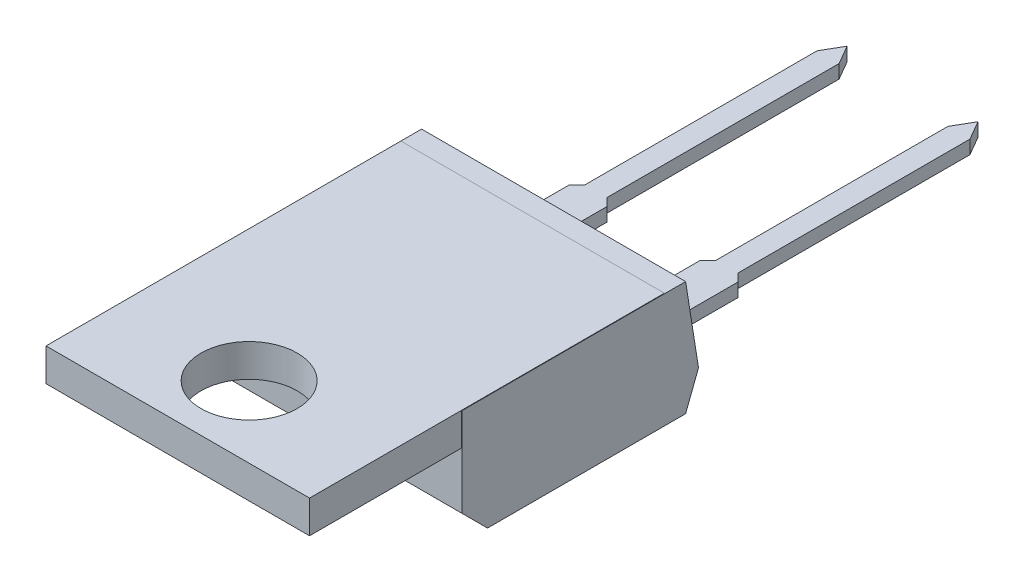
ISO-10303-21;
HEADER;
FILE_DESCRIPTION(('STEP AP214'),'2;1');
FILE_NAME('part.step','',(''),(''),'','','');
FILE_SCHEMA(('AUTOMOTIVE_DESIGN { 1 0 10303 214 1 1 1 1 }'));
ENDSEC;
DATA;
#1=APPLICATION_CONTEXT('core data for automotive mechanical design processes');
#2=APPLICATION_PROTOCOL_DEFINITION('international standard','automotive_design',2000,#1);
#3=PRODUCT_CONTEXT('',#1,'mechanical');
#4=PRODUCT('Part','Part','',(#3));
#5=PRODUCT_RELATED_PRODUCT_CATEGORY('part','',(#4));
#6=PRODUCT_DEFINITION_FORMATION('','',#4);
#7=PRODUCT_DEFINITION_CONTEXT('part definition',#1,'design');
#8=PRODUCT_DEFINITION('design','',#6,#7);
#9=PRODUCT_DEFINITION_SHAPE('','',#8);
#10=(LENGTH_UNIT() NAMED_UNIT(*) SI_UNIT(.MILLI.,.METRE.));
#11=(NAMED_UNIT(*) PLANE_ANGLE_UNIT() SI_UNIT($,.RADIAN.));
#12=(NAMED_UNIT(*) SI_UNIT($,.STERADIAN.) SOLID_ANGLE_UNIT());
#13=UNCERTAINTY_MEASURE_WITH_UNIT(LENGTH_MEASURE(1.E-05),#10,'distance_accuracy_value','');
#14=(GEOMETRIC_REPRESENTATION_CONTEXT(3) GLOBAL_UNCERTAINTY_ASSIGNED_CONTEXT((#13)) GLOBAL_UNIT_ASSIGNED_CONTEXT((#10,
#11,#12)) REPRESENTATION_CONTEXT('',''));
#15=CARTESIAN_POINT('',(0.,0.,0.));
#16=DIRECTION('',(0.,0.,1.));
#17=DIRECTION('',(1.,0.,0.));
#18=AXIS2_PLACEMENT_3D('',#15,#16,#17);
#19=CARTESIAN_POINT('',(-0.73,0.2625,0.302499999998));
#20=DIRECTION('',(0.,-1.,0.));
#21=DIRECTION('',(0.,0.,-1.));
#22=AXIS2_PLACEMENT_3D('',#19,#20,#21);
#23=PLANE('',#22);
#24=DIRECTION('',(0.,0.,1.));
#25=VECTOR('',#24,1.);
#26=CARTESIAN_POINT('',(0.73,0.2625,0.302499999998));
#27=LINE('',#26,#25);
#28=CARTESIAN_POINT('',(0.73,0.262500000000055,3.72666666666666));
#29=VERTEX_POINT('',#28);
#30=CARTESIAN_POINT('',(0.730000000000017,0.2625,0.302499999997983));
#31=VERTEX_POINT('',#30);
#32=EDGE_CURVE('E300',#29,#31,#27,.F.);
#33=ORIENTED_EDGE('',*,*,#32,.T.);
#34=DIRECTION('',(0.707106781189048,0.,0.707106781184048));
#35=VECTOR('',#34,1.);
#36=CARTESIAN_POINT('',(0.4275,0.2625,0.));
#37=LINE('',#36,#35);
#38=CARTESIAN_POINT('',(0.4275,0.2625,0.));
#39=VERTEX_POINT('',#38);
#40=EDGE_CURVE('E302',#31,#39,#37,.F.);
#41=ORIENTED_EDGE('',*,*,#40,.T.);
#42=DIRECTION('',(0.,0.,1.));
#43=VECTOR('',#42,1.);
#44=CARTESIAN_POINT('',(0.4275,0.2625,-9.009548279765));
#45=LINE('',#44,#43);
#46=CARTESIAN_POINT('',(0.427499999999931,0.262499999999999,-9.00954827976496));
#47=VERTEX_POINT('',#46);
#48=EDGE_CURVE('E307',#39,#47,#45,.F.);
#49=ORIENTED_EDGE('',*,*,#48,.T.);
#50=DIRECTION('',(0.50000000000019,0.,0.866025403784329));
#51=VECTOR('',#50,1.);
#52=CARTESIAN_POINT('',(0.,0.2625,-9.75));
#53=LINE('',#52,#51);
#54=CARTESIAN_POINT('',(0.,0.262499999999998,-9.75000000000004));
#55=VERTEX_POINT('',#54);
#56=EDGE_CURVE('E312',#47,#55,#53,.F.);
#57=ORIENTED_EDGE('',*,*,#56,.T.);
#58=DIRECTION('',(0.50000000000019,0.,-0.866025403784329));
#59=VECTOR('',#58,1.);
#60=CARTESIAN_POINT('',(-0.4275,0.2625,-9.009548279765));
#61=LINE('',#60,#59);
#62=CARTESIAN_POINT('',(-0.4275,0.262499999999999,-9.009548279765));
#63=VERTEX_POINT('',#62);
#64=EDGE_CURVE('E252',#55,#63,#61,.F.);
#65=ORIENTED_EDGE('',*,*,#64,.T.);
#66=DIRECTION('',(0.,0.,-1.));
#67=VECTOR('',#66,1.);
#68=CARTESIAN_POINT('',(-0.4275,0.2625,0.));
#69=LINE('',#68,#67);
#70=CARTESIAN_POINT('',(-0.427499999999965,0.2625,0.));
#71=VERTEX_POINT('',#70);
#72=EDGE_CURVE('E235',#63,#71,#69,.F.);
#73=ORIENTED_EDGE('',*,*,#72,.T.);
#74=DIRECTION('',(0.707106781189048,0.,-0.707106781184048));
#75=VECTOR('',#74,1.);
#76=CARTESIAN_POINT('',(-0.73,0.2625,0.302499999998));
#77=LINE('',#76,#75);
#78=CARTESIAN_POINT('',(-0.73,0.2625,0.302499999998));
#79=VERTEX_POINT('',#78);
#80=EDGE_CURVE('E240',#71,#79,#77,.F.);
#81=ORIENTED_EDGE('',*,*,#80,.T.);
#82=DIRECTION('',(0.,0.,-1.));
#83=VECTOR('',#82,1.);
#84=CARTESIAN_POINT('',(-0.73,0.2625,3.73));
#85=LINE('',#84,#83);
#86=CARTESIAN_POINT('',(-0.73,0.262500000000055,3.72666666666666));
#87=VERTEX_POINT('',#86);
#88=EDGE_CURVE('E276',#79,#87,#85,.F.);
#89=ORIENTED_EDGE('',*,*,#88,.T.);
#90=DIRECTION('',(1.,0.,0.));
#91=VECTOR('',#90,1.);
#92=CARTESIAN_POINT('',(-0.73,0.262500000000002,3.726666666667));
#93=LINE('',#92,#91);
#94=EDGE_CURVE('E264',#29,#87,#93,.F.);
#95=ORIENTED_EDGE('',*,*,#94,.F.);
#96=EDGE_LOOP('',(#33,#41,#49,#57,#65,#73,#81,#89,#95));
#97=FACE_BOUND('',#96,.T.);
#98=ADVANCED_FACE('F17',(#97),#23,.F.);
#99=CARTESIAN_POINT('',(4.35,0.2625,0.3025));
#100=DIRECTION('',(0.,-1.,0.));
#101=DIRECTION('',(0.,0.,-1.));
#102=AXIS2_PLACEMENT_3D('',#99,#100,#101);
#103=PLANE('',#102);
#104=DIRECTION('',(0.,0.,1.));
#105=VECTOR('',#104,1.);
#106=CARTESIAN_POINT('',(5.81,0.2625,0.3025));
#107=LINE('',#106,#105);
#108=CARTESIAN_POINT('',(5.81,0.262500000000055,3.72666666666666));
#109=VERTEX_POINT('',#108);
#110=CARTESIAN_POINT('',(5.81,0.2625,0.3025));
#111=VERTEX_POINT('',#110);
#112=EDGE_CURVE('E356',#109,#111,#107,.F.);
#113=ORIENTED_EDGE('',*,*,#112,.T.);
#114=DIRECTION('',(0.707106781186548,0.,0.707106781186548));
#115=VECTOR('',#114,1.);
#116=CARTESIAN_POINT('',(5.5075,0.2625,0.));
#117=LINE('',#116,#115);
#118=CARTESIAN_POINT('',(5.5075,0.2625,0.));
#119=VERTEX_POINT('',#118);
#120=EDGE_CURVE('E358',#111,#119,#117,.F.);
#121=ORIENTED_EDGE('',*,*,#120,.T.);
#122=DIRECTION('',(0.,0.,1.));
#123=VECTOR('',#122,1.);
#124=CARTESIAN_POINT('',(5.5075,0.2625,-9.009548279765));
#125=LINE('',#124,#123);
#126=CARTESIAN_POINT('',(5.50749999999993,0.262499999999999,-9.00954827976496));
#127=VERTEX_POINT('',#126);
#128=EDGE_CURVE('E363',#119,#127,#125,.F.);
#129=ORIENTED_EDGE('',*,*,#128,.T.);
#130=DIRECTION('',(0.50000000000019,0.,0.866025403784329));
#131=VECTOR('',#130,1.);
#132=CARTESIAN_POINT('',(5.08,0.2625,-9.75));
#133=LINE('',#132,#131);
#134=CARTESIAN_POINT('',(5.07999999999993,0.262499999999998,-9.75000000000004));
#135=VERTEX_POINT('',#134);
#136=EDGE_CURVE('E368',#127,#135,#133,.F.);
#137=ORIENTED_EDGE('',*,*,#136,.T.);
#138=DIRECTION('',(0.50000000000019,0.,-0.866025403784329));
#139=VECTOR('',#138,1.);
#140=CARTESIAN_POINT('',(4.6525,0.2625,-9.009548279765));
#141=LINE('',#140,#139);
#142=CARTESIAN_POINT('',(4.6525,0.262499999999999,-9.009548279765));
#143=VERTEX_POINT('',#142);
#144=EDGE_CURVE('E373',#135,#143,#141,.F.);
#145=ORIENTED_EDGE('',*,*,#144,.T.);
#146=DIRECTION('',(0.,0.,-1.));
#147=VECTOR('',#146,1.);
#148=CARTESIAN_POINT('',(4.6525,0.2625,0.));
#149=LINE('',#148,#147);
#150=CARTESIAN_POINT('',(4.6525,0.2625,0.));
#151=VERTEX_POINT('',#150);
#152=EDGE_CURVE('E378',#143,#151,#149,.F.);
#153=ORIENTED_EDGE('',*,*,#152,.T.);
#154=DIRECTION('',(0.707106781186548,0.,-0.707106781186548));
#155=VECTOR('',#154,1.);
#156=CARTESIAN_POINT('',(4.35,0.2625,0.3025));
#157=LINE('',#156,#155);
#158=CARTESIAN_POINT('',(4.35,0.2625,0.3025));
#159=VERTEX_POINT('',#158);
#160=EDGE_CURVE('E283',#151,#159,#157,.F.);
#161=ORIENTED_EDGE('',*,*,#160,.T.);
#162=DIRECTION('',(0.,0.,-1.));
#163=VECTOR('',#162,1.);
#164=CARTESIAN_POINT('',(4.35,0.2625,3.73));
#165=LINE('',#164,#163);
#166=CARTESIAN_POINT('',(4.35,0.262500000000055,3.72666666666666));
#167=VERTEX_POINT('',#166);
#168=EDGE_CURVE('E337',#159,#167,#165,.F.);
#169=ORIENTED_EDGE('',*,*,#168,.T.);
#170=DIRECTION('',(1.,0.,0.));
#171=VECTOR('',#170,1.);
#172=CARTESIAN_POINT('',(4.35,0.262500000000002,3.726666666667));
#173=LINE('',#172,#171);
#174=EDGE_CURVE('E249',#109,#167,#173,.F.);
#175=ORIENTED_EDGE('',*,*,#174,.F.);
#176=EDGE_LOOP('',(#113,#121,#129,#137,#145,#153,#161,#169,#175));
#177=FACE_BOUND('',#176,.T.);
#178=ADVANCED_FACE('F655',(#177),#103,.F.);
#179=CARTESIAN_POINT('',(-0.73,0.2625,0.302499999998));
#180=DIRECTION('',(0.707106781184048,0.,0.707106781189048));
#181=DIRECTION('',(0.707106781189048,0.,-0.707106781184048));
#182=AXIS2_PLACEMENT_3D('',#179,#180,#181);
#183=PLANE('',#182);
#184=DIRECTION('',(0.,1.,0.));
#185=VECTOR('',#184,1.);
#186=CARTESIAN_POINT('',(-0.4275,0.2625,0.));
#187=LINE('',#186,#185);
#188=CARTESIAN_POINT('',(-0.427499999999965,-0.2625,0.));
#189=VERTEX_POINT('',#188);
#190=EDGE_CURVE('E242',#71,#189,#187,.F.);
#191=ORIENTED_EDGE('',*,*,#190,.T.);
#192=DIRECTION('',(0.707106781188885,0.,-0.70710678118421));
#193=VECTOR('',#192,1.);
#194=CARTESIAN_POINT('',(-0.73,-0.2625,0.302499999998));
#195=LINE('',#194,#193);
#196=CARTESIAN_POINT('',(-0.73,-0.2625,0.302499999998));
#197=VERTEX_POINT('',#196);
#198=EDGE_CURVE('E330',#197,#189,#195,.T.);
#199=ORIENTED_EDGE('',*,*,#198,.F.);
#200=DIRECTION('',(0.,1.,0.));
#201=VECTOR('',#200,1.);
#202=CARTESIAN_POINT('',(-0.73,0.2625,0.302499999998));
#203=LINE('',#202,#201);
#204=EDGE_CURVE('E245',#197,#79,#203,.T.);
#205=ORIENTED_EDGE('',*,*,#204,.T.);
#206=ORIENTED_EDGE('',*,*,#80,.F.);
#207=EDGE_LOOP('',(#191,#199,#205,#206));
#208=FACE_BOUND('',#207,.T.);
#209=ADVANCED_FACE('F241',(#208),#183,.F.);
#210=CARTESIAN_POINT('',(-0.4275,0.2625,0.));
#211=DIRECTION('',(1.,0.,0.));
#212=DIRECTION('',(0.,0.,-1.));
#213=AXIS2_PLACEMENT_3D('',#210,#211,#212);
#214=PLANE('',#213);
#215=DIRECTION('',(0.,1.,0.));
#216=VECTOR('',#215,1.);
#217=CARTESIAN_POINT('',(-0.4275,0.2625,-9.009548279765));
#218=LINE('',#217,#216);
#219=CARTESIAN_POINT('',(-0.4275,-0.262500000000002,-9.009548279765));
#220=VERTEX_POINT('',#219);
#221=EDGE_CURVE('E254',#63,#220,#218,.F.);
#222=ORIENTED_EDGE('',*,*,#221,.T.);
#223=DIRECTION('',(0.,0.,-1.));
#224=VECTOR('',#223,1.);
#225=CARTESIAN_POINT('',(-0.4275,-0.2625,0.302499999998));
#226=LINE('',#225,#224);
#227=EDGE_CURVE('E258',#189,#220,#226,.T.);
#228=ORIENTED_EDGE('',*,*,#227,.F.);
#229=ORIENTED_EDGE('',*,*,#190,.F.);
#230=ORIENTED_EDGE('',*,*,#72,.F.);
#231=EDGE_LOOP('',(#222,#228,#229,#230));
#232=FACE_BOUND('',#231,.T.);
#233=ADVANCED_FACE('F256',(#232),#214,.F.);
#234=CARTESIAN_POINT('',(-0.4275,0.2625,-9.009548279765));
#235=DIRECTION('',(0.866025403784329,0.,0.50000000000019));
#236=DIRECTION('',(0.50000000000019,0.,-0.866025403784329));
#237=AXIS2_PLACEMENT_3D('',#234,#235,#236);
#238=PLANE('',#237);
#239=DIRECTION('',(0.,1.,0.));
#240=VECTOR('',#239,1.);
#241=CARTESIAN_POINT('',(0.,0.2625,-9.75));
#242=LINE('',#241,#240);
#243=CARTESIAN_POINT('',(0.,-0.262500000000002,-9.75000000000004));
#244=VERTEX_POINT('',#243);
#245=EDGE_CURVE('E314',#55,#244,#242,.F.);
#246=ORIENTED_EDGE('',*,*,#245,.T.);
#247=DIRECTION('',(0.500000000000352,0.,-0.866025403784235));
#248=VECTOR('',#247,1.);
#249=CARTESIAN_POINT('',(-0.4275,-0.262500000000006,-9.009548279765));
#250=LINE('',#249,#248);
#251=EDGE_CURVE('E319',#220,#244,#250,.T.);
#252=ORIENTED_EDGE('',*,*,#251,.F.);
#253=ORIENTED_EDGE('',*,*,#221,.F.);
#254=ORIENTED_EDGE('',*,*,#64,.F.);
#255=EDGE_LOOP('',(#246,#252,#253,#254));
#256=FACE_BOUND('',#255,.T.);
#257=ADVANCED_FACE('F320',(#256),#238,.F.);
#258=CARTESIAN_POINT('',(0.,0.2625,-9.75));
#259=DIRECTION('',(-0.866025403784329,0.,0.50000000000019));
#260=DIRECTION('',(0.50000000000019,0.,0.866025403784329));
#261=AXIS2_PLACEMENT_3D('',#258,#259,#260);
#262=PLANE('',#261);
#263=DIRECTION('',(0.,1.,0.));
#264=VECTOR('',#263,1.);
#265=CARTESIAN_POINT('',(0.4275,0.2625,-9.009548279765));
#266=LINE('',#265,#264);
#267=CARTESIAN_POINT('',(0.427499999999931,-0.262500000000002,-9.00954827976496));
#268=VERTEX_POINT('',#267);
#269=EDGE_CURVE('E310',#47,#268,#266,.F.);
#270=ORIENTED_EDGE('',*,*,#269,.T.);
#271=DIRECTION('',(0.500000000000352,0.,0.866025403784235));
#272=VECTOR('',#271,1.);
#273=CARTESIAN_POINT('',(0.,-0.262500000000007,-9.75));
#274=LINE('',#273,#272);
#275=EDGE_CURVE('E325',#244,#268,#274,.T.);
#276=ORIENTED_EDGE('',*,*,#275,.F.);
#277=ORIENTED_EDGE('',*,*,#245,.F.);
#278=ORIENTED_EDGE('',*,*,#56,.F.);
#279=EDGE_LOOP('',(#270,#276,#277,#278));
#280=FACE_BOUND('',#279,.T.);
#281=ADVANCED_FACE('F417',(#280),#262,.F.);
#282=CARTESIAN_POINT('',(0.4275,0.2625,-9.009548279765));
#283=DIRECTION('',(-1.,0.,0.));
#284=DIRECTION('',(0.,0.,1.));
#285=AXIS2_PLACEMENT_3D('',#282,#283,#284);
#286=PLANE('',#285);
#287=DIRECTION('',(0.,1.,0.));
#288=VECTOR('',#287,1.);
#289=CARTESIAN_POINT('',(0.4275,0.2625,0.));
#290=LINE('',#289,#288);
#291=CARTESIAN_POINT('',(0.4275,-0.2625,0.));
#292=VERTEX_POINT('',#291);
#293=EDGE_CURVE('E305',#39,#292,#290,.F.);
#294=ORIENTED_EDGE('',*,*,#293,.T.);
#295=DIRECTION('',(0.,0.,-1.));
#296=VECTOR('',#295,1.);
#297=CARTESIAN_POINT('',(0.4275,-0.2625,0.302499999998));
#298=LINE('',#297,#296);
#299=EDGE_CURVE('E413',#268,#292,#298,.F.);
#300=ORIENTED_EDGE('',*,*,#299,.F.);
#301=ORIENTED_EDGE('',*,*,#269,.F.);
#302=ORIENTED_EDGE('',*,*,#48,.F.);
#303=EDGE_LOOP('',(#294,#300,#301,#302));
#304=FACE_BOUND('',#303,.T.);
#305=ADVANCED_FACE('F420',(#304),#286,.F.);
#306=CARTESIAN_POINT('',(0.4275,0.2625,0.));
#307=DIRECTION('',(-0.707106781184048,0.,0.707106781189048));
#308=DIRECTION('',(0.707106781189048,0.,0.707106781184048));
#309=AXIS2_PLACEMENT_3D('',#306,#307,#308);
#310=PLANE('',#309);
#311=DIRECTION('',(0.,1.,0.));
#312=VECTOR('',#311,1.);
#313=CARTESIAN_POINT('',(0.73,0.2625,0.302499999998));
#314=LINE('',#313,#312);
#315=CARTESIAN_POINT('',(0.730000000000035,-0.2625,0.302499999997965));
#316=VERTEX_POINT('',#315);
#317=EDGE_CURVE('E298',#31,#316,#314,.F.);
#318=ORIENTED_EDGE('',*,*,#317,.T.);
#319=DIRECTION('',(0.707106781188885,0.,0.70710678118421));
#320=VECTOR('',#319,1.);
#321=CARTESIAN_POINT('',(0.4275,-0.2625,0.));
#322=LINE('',#321,#320);
#323=EDGE_CURVE('E410',#292,#316,#322,.T.);
#324=ORIENTED_EDGE('',*,*,#323,.F.);
#325=ORIENTED_EDGE('',*,*,#293,.F.);
#326=ORIENTED_EDGE('',*,*,#40,.F.);
#327=EDGE_LOOP('',(#318,#324,#325,#326));
#328=FACE_BOUND('',#327,.T.);
#329=ADVANCED_FACE('F425',(#328),#310,.F.);
#330=CARTESIAN_POINT('',(0.73,0.2625,0.302499999998));
#331=DIRECTION('',(-1.,0.,0.));
#332=DIRECTION('',(0.,0.,1.));
#333=AXIS2_PLACEMENT_3D('',#330,#331,#332);
#334=PLANE('',#333);
#335=DIRECTION('',(0.,0.932880669323476,-0.360185586611379));
#336=VECTOR('',#335,1.);
#337=CARTESIAN_POINT('',(0.73,-0.11655,3.73));
#338=LINE('',#337,#336);
#339=CARTESIAN_POINT('',(0.73,-0.116550000000006,3.72999999999998));
#340=VERTEX_POINT('',#339);
#341=CARTESIAN_POINT('',(0.730000000000001,0.,3.68499999999972));
#342=VERTEX_POINT('',#341);
#343=EDGE_CURVE('E294',#340,#342,#338,.T.);
#344=ORIENTED_EDGE('',*,*,#343,.F.);
#345=DIRECTION('',(0.,1.,0.));
#346=VECTOR('',#345,1.);
#347=CARTESIAN_POINT('',(0.73,0.2625,3.73));
#348=LINE('',#347,#346);
#349=CARTESIAN_POINT('',(0.73,-0.2625,3.73));
#350=VERTEX_POINT('',#349);
#351=EDGE_CURVE('E296',#350,#340,#348,.T.);
#352=ORIENTED_EDGE('',*,*,#351,.F.);
#353=DIRECTION('',(0.,0.,-1.));
#354=VECTOR('',#353,1.);
#355=CARTESIAN_POINT('',(0.73,-0.2625,0.302499999998));
#356=LINE('',#355,#354);
#357=EDGE_CURVE('E404',#316,#350,#356,.F.);
#358=ORIENTED_EDGE('',*,*,#357,.F.);
#359=ORIENTED_EDGE('',*,*,#317,.F.);
#360=ORIENTED_EDGE('',*,*,#32,.F.);
#361=DIRECTION('',(0.,0.987635528464269,0.156767544201932));
#362=VECTOR('',#361,1.);
#363=CARTESIAN_POINT('',(0.73,0.,3.685));
#364=LINE('',#363,#362);
#365=EDGE_CURVE('E274',#342,#29,#364,.T.);
#366=ORIENTED_EDGE('',*,*,#365,.F.);
#367=EDGE_LOOP('',(#344,#352,#358,#359,#360,#366));
#368=FACE_BOUND('',#367,.T.);
#369=ADVANCED_FACE('F685',(#368),#334,.F.);
#370=CARTESIAN_POINT('',(-0.73,0.2625,3.73));
#371=DIRECTION('',(1.,0.,0.));
#372=DIRECTION('',(0.,0.,-1.));
#373=AXIS2_PLACEMENT_3D('',#370,#371,#372);
#374=PLANE('',#373);
#375=ORIENTED_EDGE('',*,*,#88,.F.);
#376=ORIENTED_EDGE('',*,*,#204,.F.);
#377=DIRECTION('',(0.,0.,-1.));
#378=VECTOR('',#377,1.);
#379=CARTESIAN_POINT('',(-0.73,-0.2625,0.302499999998));
#380=LINE('',#379,#378);
#381=CARTESIAN_POINT('',(-0.73,-0.2625,3.73));
#382=VERTEX_POINT('',#381);
#383=EDGE_CURVE('E402',#382,#197,#380,.T.);
#384=ORIENTED_EDGE('',*,*,#383,.F.);
#385=DIRECTION('',(0.,1.,0.));
#386=VECTOR('',#385,1.);
#387=CARTESIAN_POINT('',(-0.73,0.2625,3.73));
#388=LINE('',#387,#386);
#389=CARTESIAN_POINT('',(-0.73,-0.116550000000006,3.72999999999998));
#390=VERTEX_POINT('',#389);
#391=EDGE_CURVE('E290',#390,#382,#388,.F.);
#392=ORIENTED_EDGE('',*,*,#391,.F.);
#393=DIRECTION('',(0.,-0.932880669323476,0.360185586611379));
#394=VECTOR('',#393,1.);
#395=CARTESIAN_POINT('',(-0.73,0.,3.685));
#396=LINE('',#395,#394);
#397=CARTESIAN_POINT('',(-0.73,0.,3.68499999999972));
#398=VERTEX_POINT('',#397);
#399=EDGE_CURVE('E282',#398,#390,#396,.T.);
#400=ORIENTED_EDGE('',*,*,#399,.F.);
#401=DIRECTION('',(0.,-0.987635528464269,-0.156767544201932));
#402=VECTOR('',#401,1.);
#403=CARTESIAN_POINT('',(-0.73,0.2625,3.726666666667));
#404=LINE('',#403,#402);
#405=EDGE_CURVE('E270',#87,#398,#404,.T.);
#406=ORIENTED_EDGE('',*,*,#405,.F.);
#407=EDGE_LOOP('',(#375,#376,#384,#392,#400,#406));
#408=FACE_BOUND('',#407,.T.);
#409=ADVANCED_FACE('F280',(#408),#374,.F.);
#410=CARTESIAN_POINT('',(4.35,0.2625,0.3025));
#411=DIRECTION('',(0.707106781186548,0.,0.707106781186548));
#412=DIRECTION('',(0.707106781186548,0.,-0.707106781186548));
#413=AXIS2_PLACEMENT_3D('',#410,#411,#412);
#414=PLANE('',#413);
#415=DIRECTION('',(0.,1.,0.));
#416=VECTOR('',#415,1.);
#417=CARTESIAN_POINT('',(4.6525,0.2625,0.));
#418=LINE('',#417,#416);
#419=CARTESIAN_POINT('',(4.6525,-0.2625,0.));
#420=VERTEX_POINT('',#419);
#421=EDGE_CURVE('E285',#151,#420,#418,.F.);
#422=ORIENTED_EDGE('',*,*,#421,.T.);
#423=DIRECTION('',(0.707106781186549,0.,-0.707106781186547));
#424=VECTOR('',#423,1.);
#425=CARTESIAN_POINT('',(4.35,-0.2625,0.3025));
#426=LINE('',#425,#424);
#427=CARTESIAN_POINT('',(4.35,-0.2625,0.3025));
#428=VERTEX_POINT('',#427);
#429=EDGE_CURVE('E385',#428,#420,#426,.T.);
#430=ORIENTED_EDGE('',*,*,#429,.F.);
#431=DIRECTION('',(0.,1.,0.));
#432=VECTOR('',#431,1.);
#433=CARTESIAN_POINT('',(4.35,0.2625,0.3025));
#434=LINE('',#433,#432);
#435=EDGE_CURVE('E340',#428,#159,#434,.T.);
#436=ORIENTED_EDGE('',*,*,#435,.T.);
#437=ORIENTED_EDGE('',*,*,#160,.F.);
#438=EDGE_LOOP('',(#422,#430,#436,#437));
#439=FACE_BOUND('',#438,.T.);
#440=ADVANCED_FACE('F383',(#439),#414,.F.);
#441=CARTESIAN_POINT('',(4.6525,0.2625,0.));
#442=DIRECTION('',(1.,0.,0.));
#443=DIRECTION('',(0.,0.,-1.));
#444=AXIS2_PLACEMENT_3D('',#441,#442,#443);
#445=PLANE('',#444);
#446=DIRECTION('',(0.,1.,0.));
#447=VECTOR('',#446,1.);
#448=CARTESIAN_POINT('',(4.6525,0.2625,-9.009548279765));
#449=LINE('',#448,#447);
#450=CARTESIAN_POINT('',(4.6525,-0.262500000000002,-9.009548279765));
#451=VERTEX_POINT('',#450);
#452=EDGE_CURVE('E376',#143,#451,#449,.F.);
#453=ORIENTED_EDGE('',*,*,#452,.T.);
#454=DIRECTION('',(0.,0.,-1.));
#455=VECTOR('',#454,1.);
#456=CARTESIAN_POINT('',(4.6525,-0.2625,0.3025));
#457=LINE('',#456,#455);
#458=EDGE_CURVE('E389',#420,#451,#457,.T.);
#459=ORIENTED_EDGE('',*,*,#458,.F.);
#460=ORIENTED_EDGE('',*,*,#421,.F.);
#461=ORIENTED_EDGE('',*,*,#152,.F.);
#462=EDGE_LOOP('',(#453,#459,#460,#461));
#463=FACE_BOUND('',#462,.T.);
#464=ADVANCED_FACE('F390',(#463),#445,.F.);
#465=CARTESIAN_POINT('',(4.6525,0.2625,-9.009548279765));
#466=DIRECTION('',(0.866025403784329,0.,0.50000000000019));
#467=DIRECTION('',(0.50000000000019,0.,-0.866025403784329));
#468=AXIS2_PLACEMENT_3D('',#465,#466,#467);
#469=PLANE('',#468);
#470=DIRECTION('',(0.,1.,0.));
#471=VECTOR('',#470,1.);
#472=CARTESIAN_POINT('',(5.08,0.2625,-9.75));
#473=LINE('',#472,#471);
#474=CARTESIAN_POINT('',(5.07999999999993,-0.262500000000002,-9.75000000000004));
#475=VERTEX_POINT('',#474);
#476=EDGE_CURVE('E371',#135,#475,#473,.F.);
#477=ORIENTED_EDGE('',*,*,#476,.T.);
#478=DIRECTION('',(0.500000000000352,0.,-0.866025403784235));
#479=VECTOR('',#478,1.);
#480=CARTESIAN_POINT('',(4.6525,-0.262500000000006,-9.009548279765));
#481=LINE('',#480,#479);
#482=EDGE_CURVE('E395',#451,#475,#481,.T.);
#483=ORIENTED_EDGE('',*,*,#482,.F.);
#484=ORIENTED_EDGE('',*,*,#452,.F.);
#485=ORIENTED_EDGE('',*,*,#144,.F.);
#486=EDGE_LOOP('',(#477,#483,#484,#485));
#487=FACE_BOUND('',#486,.T.);
#488=ADVANCED_FACE('F456',(#487),#469,.F.);
#489=CARTESIAN_POINT('',(5.08,0.2625,-9.75));
#490=DIRECTION('',(-0.866025403784329,0.,0.50000000000019));
#491=DIRECTION('',(0.50000000000019,0.,0.866025403784329));
#492=AXIS2_PLACEMENT_3D('',#489,#490,#491);
#493=PLANE('',#492);
#494=DIRECTION('',(0.,1.,0.));
#495=VECTOR('',#494,1.);
#496=CARTESIAN_POINT('',(5.5075,0.2625,-9.009548279765));
#497=LINE('',#496,#495);
#498=CARTESIAN_POINT('',(5.50749999999993,-0.262500000000002,-9.00954827976496));
#499=VERTEX_POINT('',#498);
#500=EDGE_CURVE('E366',#127,#499,#497,.F.);
#501=ORIENTED_EDGE('',*,*,#500,.T.);
#502=DIRECTION('',(0.500000000000352,0.,0.866025403784235));
#503=VECTOR('',#502,1.);
#504=CARTESIAN_POINT('',(5.08,-0.262500000000007,-9.75));
#505=LINE('',#504,#503);
#506=EDGE_CURVE('E452',#475,#499,#505,.T.);
#507=ORIENTED_EDGE('',*,*,#506,.F.);
#508=ORIENTED_EDGE('',*,*,#476,.F.);
#509=ORIENTED_EDGE('',*,*,#136,.F.);
#510=EDGE_LOOP('',(#501,#507,#508,#509));
#511=FACE_BOUND('',#510,.T.);
#512=ADVANCED_FACE('F459',(#511),#493,.F.);
#513=CARTESIAN_POINT('',(5.5075,0.2625,-9.009548279765));
#514=DIRECTION('',(-1.,0.,0.));
#515=DIRECTION('',(0.,0.,1.));
#516=AXIS2_PLACEMENT_3D('',#513,#514,#515);
#517=PLANE('',#516);
#518=DIRECTION('',(0.,1.,0.));
#519=VECTOR('',#518,1.);
#520=CARTESIAN_POINT('',(5.5075,0.2625,0.));
#521=LINE('',#520,#519);
#522=CARTESIAN_POINT('',(5.5075,-0.2625,0.));
#523=VERTEX_POINT('',#522);
#524=EDGE_CURVE('E361',#119,#523,#521,.F.);
#525=ORIENTED_EDGE('',*,*,#524,.T.);
#526=DIRECTION('',(0.,0.,-1.));
#527=VECTOR('',#526,1.);
#528=CARTESIAN_POINT('',(5.5075,-0.2625,0.3025));
#529=LINE('',#528,#527);
#530=EDGE_CURVE('E449',#499,#523,#529,.F.);
#531=ORIENTED_EDGE('',*,*,#530,.F.);
#532=ORIENTED_EDGE('',*,*,#500,.F.);
#533=ORIENTED_EDGE('',*,*,#128,.F.);
#534=EDGE_LOOP('',(#525,#531,#532,#533));
#535=FACE_BOUND('',#534,.T.);
#536=ADVANCED_FACE('F463',(#535),#517,.F.);
#537=CARTESIAN_POINT('',(5.5075,0.2625,0.));
#538=DIRECTION('',(-0.707106781186548,0.,0.707106781186548));
#539=DIRECTION('',(0.707106781186548,0.,0.707106781186548));
#540=AXIS2_PLACEMENT_3D('',#537,#538,#539);
#541=PLANE('',#540);
#542=DIRECTION('',(0.,1.,0.));
#543=VECTOR('',#542,1.);
#544=CARTESIAN_POINT('',(5.81,0.2625,0.3025));
#545=LINE('',#544,#543);
#546=CARTESIAN_POINT('',(5.81,-0.2625,0.3025));
#547=VERTEX_POINT('',#546);
#548=EDGE_CURVE('E354',#111,#547,#545,.F.);
#549=ORIENTED_EDGE('',*,*,#548,.T.);
#550=DIRECTION('',(0.707106781186547,0.,0.707106781186548));
#551=VECTOR('',#550,1.);
#552=CARTESIAN_POINT('',(5.5075,-0.2625,0.));
#553=LINE('',#552,#551);
#554=EDGE_CURVE('E446',#523,#547,#553,.T.);
#555=ORIENTED_EDGE('',*,*,#554,.F.);
#556=ORIENTED_EDGE('',*,*,#524,.F.);
#557=ORIENTED_EDGE('',*,*,#120,.F.);
#558=EDGE_LOOP('',(#549,#555,#556,#557));
#559=FACE_BOUND('',#558,.T.);
#560=ADVANCED_FACE('F469',(#559),#541,.F.);
#561=CARTESIAN_POINT('',(5.81,0.2625,0.3025));
#562=DIRECTION('',(-1.,0.,0.));
#563=DIRECTION('',(0.,0.,1.));
#564=AXIS2_PLACEMENT_3D('',#561,#562,#563);
#565=PLANE('',#564);
#566=DIRECTION('',(0.,0.932880669323476,-0.360185586611379));
#567=VECTOR('',#566,1.);
#568=CARTESIAN_POINT('',(5.81,-0.11655,3.73));
#569=LINE('',#568,#567);
#570=CARTESIAN_POINT('',(5.81,-0.116550000000006,3.72999999999998));
#571=VERTEX_POINT('',#570);
#572=CARTESIAN_POINT('',(5.81,0.,3.68499999999972));
#573=VERTEX_POINT('',#572);
#574=EDGE_CURVE('E350',#571,#573,#569,.T.);
#575=ORIENTED_EDGE('',*,*,#574,.F.);
#576=DIRECTION('',(0.,1.,0.));
#577=VECTOR('',#576,1.);
#578=CARTESIAN_POINT('',(5.81,0.2625,3.73));
#579=LINE('',#578,#577);
#580=CARTESIAN_POINT('',(5.81,-0.2625,3.73));
#581=VERTEX_POINT('',#580);
#582=EDGE_CURVE('E352',#581,#571,#579,.T.);
#583=ORIENTED_EDGE('',*,*,#582,.F.);
#584=DIRECTION('',(0.,0.,-1.));
#585=VECTOR('',#584,1.);
#586=CARTESIAN_POINT('',(5.81,-0.2625,0.3025));
#587=LINE('',#586,#585);
#588=EDGE_CURVE('E440',#547,#581,#587,.F.);
#589=ORIENTED_EDGE('',*,*,#588,.F.);
#590=ORIENTED_EDGE('',*,*,#548,.F.);
#591=ORIENTED_EDGE('',*,*,#112,.F.);
#592=DIRECTION('',(0.,0.987635528464269,0.156767544201932));
#593=VECTOR('',#592,1.);
#594=CARTESIAN_POINT('',(5.81,0.,3.685));
#595=LINE('',#594,#593);
#596=EDGE_CURVE('E347',#573,#109,#595,.T.);
#597=ORIENTED_EDGE('',*,*,#596,.F.);
#598=EDGE_LOOP('',(#575,#583,#589,#590,#591,#597));
#599=FACE_BOUND('',#598,.T.);
#600=ADVANCED_FACE('F475',(#599),#565,.F.);
#601=CARTESIAN_POINT('',(4.35,0.2625,3.73));
#602=DIRECTION('',(1.,0.,0.));
#603=DIRECTION('',(0.,0.,-1.));
#604=AXIS2_PLACEMENT_3D('',#601,#602,#603);
#605=PLANE('',#604);
#606=ORIENTED_EDGE('',*,*,#168,.F.);
#607=ORIENTED_EDGE('',*,*,#435,.F.);
#608=DIRECTION('',(0.,0.,-1.));
#609=VECTOR('',#608,1.);
#610=CARTESIAN_POINT('',(4.35,-0.2625,0.3025));
#611=LINE('',#610,#609);
#612=CARTESIAN_POINT('',(4.35,-0.2625,3.73));
#613=VERTEX_POINT('',#612);
#614=EDGE_CURVE('E401',#613,#428,#611,.T.);
#615=ORIENTED_EDGE('',*,*,#614,.F.);
#616=DIRECTION('',(0.,1.,0.));
#617=VECTOR('',#616,1.);
#618=CARTESIAN_POINT('',(4.35,0.2625,3.73));
#619=LINE('',#618,#617);
#620=CARTESIAN_POINT('',(4.35,-0.116550000000006,3.72999999999998));
#621=VERTEX_POINT('',#620);
#622=EDGE_CURVE('E343',#621,#613,#619,.F.);
#623=ORIENTED_EDGE('',*,*,#622,.F.);
#624=DIRECTION('',(0.,-0.932880669323476,0.360185586611379));
#625=VECTOR('',#624,1.);
#626=CARTESIAN_POINT('',(4.35,0.,3.685));
#627=LINE('',#626,#625);
#628=CARTESIAN_POINT('',(4.35,0.,3.68499999999972));
#629=VERTEX_POINT('',#628);
#630=EDGE_CURVE('E345',#629,#621,#627,.T.);
#631=ORIENTED_EDGE('',*,*,#630,.F.);
#632=DIRECTION('',(0.,-0.987635528464269,-0.156767544201932));
#633=VECTOR('',#632,1.);
#634=CARTESIAN_POINT('',(4.35,0.2625,3.726666666667));
#635=LINE('',#634,#633);
#636=EDGE_CURVE('E332',#167,#629,#635,.T.);
#637=ORIENTED_EDGE('',*,*,#636,.F.);
#638=EDGE_LOOP('',(#606,#607,#615,#623,#631,#637));
#639=FACE_BOUND('',#638,.T.);
#640=ADVANCED_FACE('F660',(#639),#605,.F.);
#641=CARTESIAN_POINT('',(-0.73,-0.2625,0.302499999998));
#642=DIRECTION('',(0.,-1.,0.));
#643=DIRECTION('',(0.,0.,-1.));
#644=AXIS2_PLACEMENT_3D('',#641,#642,#643);
#645=PLANE('',#644);
#646=DIRECTION('',(1.,0.,0.));
#647=VECTOR('',#646,1.);
#648=CARTESIAN_POINT('',(0.73,-0.2625,3.73));
#649=LINE('',#648,#647);
#650=EDGE_CURVE('E429',#350,#382,#649,.F.);
#651=ORIENTED_EDGE('',*,*,#650,.T.);
#652=ORIENTED_EDGE('',*,*,#383,.T.);
#653=ORIENTED_EDGE('',*,*,#198,.T.);
#654=ORIENTED_EDGE('',*,*,#227,.T.);
#655=ORIENTED_EDGE('',*,*,#251,.T.);
#656=ORIENTED_EDGE('',*,*,#275,.T.);
#657=ORIENTED_EDGE('',*,*,#299,.T.);
#658=ORIENTED_EDGE('',*,*,#323,.T.);
#659=ORIENTED_EDGE('',*,*,#357,.T.);
#660=EDGE_LOOP('',(#651,#652,#653,#654,#655,#656,#657,#658,#659));
#661=FACE_BOUND('',#660,.T.);
#662=ADVANCED_FACE('F328',(#661),#645,.T.);
#663=CARTESIAN_POINT('',(4.35,-0.2625,0.3025));
#664=DIRECTION('',(0.,-1.,0.));
#665=DIRECTION('',(0.,0.,-1.));
#666=AXIS2_PLACEMENT_3D('',#663,#664,#665);
#667=PLANE('',#666);
#668=DIRECTION('',(1.,0.,0.));
#669=VECTOR('',#668,1.);
#670=CARTESIAN_POINT('',(5.81,-0.2625,3.73));
#671=LINE('',#670,#669);
#672=EDGE_CURVE('E436',#581,#613,#671,.F.);
#673=ORIENTED_EDGE('',*,*,#672,.T.);
#674=ORIENTED_EDGE('',*,*,#614,.T.);
#675=ORIENTED_EDGE('',*,*,#429,.T.);
#676=ORIENTED_EDGE('',*,*,#458,.T.);
#677=ORIENTED_EDGE('',*,*,#482,.T.);
#678=ORIENTED_EDGE('',*,*,#506,.T.);
#679=ORIENTED_EDGE('',*,*,#530,.T.);
#680=ORIENTED_EDGE('',*,*,#554,.T.);
#681=ORIENTED_EDGE('',*,*,#588,.T.);
#682=EDGE_LOOP('',(#673,#674,#675,#676,#677,#678,#679,#680,#681));
#683=FACE_BOUND('',#682,.T.);
#684=ADVANCED_FACE('F399',(#683),#667,.T.);
#685=CARTESIAN_POINT('',(0.73,0.2625,3.73));
#686=DIRECTION('',(0.,0.,-1.));
#687=DIRECTION('',(0.,1.,0.));
#688=AXIS2_PLACEMENT_3D('',#685,#686,#687);
#689=PLANE('',#688);
#690=ORIENTED_EDGE('',*,*,#650,.F.);
#691=ORIENTED_EDGE('',*,*,#351,.T.);
#692=DIRECTION('',(1.,0.,0.));
#693=VECTOR('',#692,1.);
#694=CARTESIAN_POINT('',(-2.585,-0.116550000000024,3.72999999999994));
#695=LINE('',#694,#693);
#696=EDGE_CURVE('E438',#390,#340,#695,.T.);
#697=ORIENTED_EDGE('',*,*,#696,.F.);
#698=ORIENTED_EDGE('',*,*,#391,.T.);
#699=EDGE_LOOP('',(#690,#691,#697,#698));
#700=FACE_BOUND('',#699,.T.);
#701=ADVANCED_FACE('F432',(#700),#689,.F.);
#702=CARTESIAN_POINT('',(5.81,0.2625,3.73));
#703=DIRECTION('',(0.,0.,-1.));
#704=DIRECTION('',(0.,1.,0.));
#705=AXIS2_PLACEMENT_3D('',#702,#703,#704);
#706=PLANE('',#705);
#707=ORIENTED_EDGE('',*,*,#672,.F.);
#708=ORIENTED_EDGE('',*,*,#582,.T.);
#709=DIRECTION('',(1.,0.,0.));
#710=VECTOR('',#709,1.);
#711=CARTESIAN_POINT('',(-2.585,-0.116550000000024,3.72999999999994));
#712=LINE('',#711,#710);
#713=EDGE_CURVE('E481',#621,#571,#712,.T.);
#714=ORIENTED_EDGE('',*,*,#713,.F.);
#715=ORIENTED_EDGE('',*,*,#622,.T.);
#716=EDGE_LOOP('',(#707,#708,#714,#715));
#717=FACE_BOUND('',#716,.T.);
#718=ADVANCED_FACE('F480',(#717),#706,.F.);
#719=CARTESIAN_POINT('',(-2.585,-1.295,4.185));
#720=DIRECTION('',(0.,-1.,0.));
#721=DIRECTION('',(0.,0.,-1.));
#722=AXIS2_PLACEMENT_3D('',#719,#720,#721);
#723=PLANE('',#722);
#724=DIRECTION('',(1.,0.,0.));
#725=VECTOR('',#724,1.);
#726=CARTESIAN_POINT('',(-2.585,-1.295,11.875000000001));
#727=LINE('',#726,#725);
#728=CARTESIAN_POINT('',(-2.585,-1.295,11.875000000001));
#729=VERTEX_POINT('',#728);
#730=CARTESIAN_POINT('',(7.665,-1.295,11.875000000001));
#731=VERTEX_POINT('',#730);
#732=EDGE_CURVE('E493',#729,#731,#727,.T.);
#733=ORIENTED_EDGE('',*,*,#732,.F.);
#734=DIRECTION('',(0.,0.,-1.));
#735=VECTOR('',#734,1.);
#736=CARTESIAN_POINT('',(-2.585,-1.295,3.685));
#737=LINE('',#736,#735);
#738=CARTESIAN_POINT('',(-2.585,-1.29500000000007,4.18499999999982));
#739=VERTEX_POINT('',#738);
#740=EDGE_CURVE('E500',#729,#739,#737,.T.);
#741=ORIENTED_EDGE('',*,*,#740,.T.);
#742=DIRECTION('',(1.,0.,0.));
#743=VECTOR('',#742,1.);
#744=CARTESIAN_POINT('',(-2.585,-1.29500000000027,4.1849999999993));
#745=LINE('',#744,#743);
#746=CARTESIAN_POINT('',(7.665,-1.29500000000007,4.18499999999982));
#747=VERTEX_POINT('',#746);
#748=EDGE_CURVE('E490',#747,#739,#745,.F.);
#749=ORIENTED_EDGE('',*,*,#748,.F.);
#750=DIRECTION('',(0.,0.,-1.));
#751=VECTOR('',#750,1.);
#752=CARTESIAN_POINT('',(7.665,-1.295,3.685));
#753=LINE('',#752,#751);
#754=EDGE_CURVE('E507',#731,#747,#753,.T.);
#755=ORIENTED_EDGE('',*,*,#754,.F.);
#756=EDGE_LOOP('',(#733,#741,#749,#755));
#757=FACE_BOUND('',#756,.T.);
#758=ADVANCED_FACE('F653',(#757),#723,.T.);
#759=CARTESIAN_POINT('',(-2.585,0.,3.685));
#760=DIRECTION('',(0.,-0.360185586610873,-0.932880669323672));
#761=DIRECTION('',(0.,0.932880669323672,-0.360185586610873));
#762=AXIS2_PLACEMENT_3D('',#759,#760,#761);
#763=PLANE('',#762);
#764=DIRECTION('',(0.,0.932880669323476,-0.36018558661138));
#765=VECTOR('',#764,1.);
#766=CARTESIAN_POINT('',(7.665,-1.295,4.185));
#767=LINE('',#766,#765);
#768=CARTESIAN_POINT('',(7.665,0.,3.68499999999972));
#769=VERTEX_POINT('',#768);
#770=EDGE_CURVE('E510',#747,#769,#767,.T.);
#771=ORIENTED_EDGE('',*,*,#770,.F.);
#772=ORIENTED_EDGE('',*,*,#748,.T.);
#773=DIRECTION('',(0.,0.932880669323476,-0.36018558661138));
#774=VECTOR('',#773,1.);
#775=CARTESIAN_POINT('',(-2.585,-1.295,4.185));
#776=LINE('',#775,#774);
#777=CARTESIAN_POINT('',(-2.585,0.,3.68499999999972));
#778=VERTEX_POINT('',#777);
#779=EDGE_CURVE('E502',#739,#778,#776,.T.);
#780=ORIENTED_EDGE('',*,*,#779,.T.);
#781=DIRECTION('',(1.,0.,0.));
#782=VECTOR('',#781,1.);
#783=CARTESIAN_POINT('',(-2.585,1.80411241501588E-13,3.68499999999886));
#784=LINE('',#783,#782);
#785=EDGE_CURVE('E522',#398,#778,#784,.F.);
#786=ORIENTED_EDGE('',*,*,#785,.F.);
#787=ORIENTED_EDGE('',*,*,#399,.T.);
#788=ORIENTED_EDGE('',*,*,#696,.T.);
#789=ORIENTED_EDGE('',*,*,#343,.T.);
#790=DIRECTION('',(1.,0.,0.));
#791=VECTOR('',#790,1.);
#792=CARTESIAN_POINT('',(-2.585,1.80411241501588E-13,3.68499999999886));
#793=LINE('',#792,#791);
#794=EDGE_CURVE('E520',#629,#342,#793,.F.);
#795=ORIENTED_EDGE('',*,*,#794,.F.);
#796=ORIENTED_EDGE('',*,*,#630,.T.);
#797=ORIENTED_EDGE('',*,*,#713,.T.);
#798=ORIENTED_EDGE('',*,*,#574,.T.);
#799=DIRECTION('',(1.,0.,0.));
#800=VECTOR('',#799,1.);
#801=CARTESIAN_POINT('',(-2.585,1.80411241501588E-13,3.68499999999886));
#802=LINE('',#801,#800);
#803=EDGE_CURVE('E518',#769,#573,#802,.F.);
#804=ORIENTED_EDGE('',*,*,#803,.F.);
#805=EDGE_LOOP('',(#771,#772,#780,#786,#787,#788,#789,#795,#796,#797,#798,#804));
#806=FACE_BOUND('',#805,.T.);
#807=ADVANCED_FACE('F485',(#806),#763,.T.);
#808=CARTESIAN_POINT('',(-2.585,-1.295,11.875000000001));
#809=DIRECTION('',(0.,-0.707106781186048,0.707106781187048));
#810=DIRECTION('',(0.,-0.707106781187048,-0.707106781186048));
#811=AXIS2_PLACEMENT_3D('',#808,#809,#810);
#812=PLANE('',#811);
#813=DIRECTION('',(1.,0.,0.));
#814=VECTOR('',#813,1.);
#815=CARTESIAN_POINT('',(-2.585,-0.295,12.875));
#816=LINE('',#815,#814);
#817=CARTESIAN_POINT('',(-2.585,-0.294999999999948,12.8749999999999));
#818=VERTEX_POINT('',#817);
#819=CARTESIAN_POINT('',(7.665,-0.294999999999896,12.8749999999999));
#820=VERTEX_POINT('',#819);
#821=EDGE_CURVE('E527',#818,#820,#816,.T.);
#822=ORIENTED_EDGE('',*,*,#821,.F.);
#823=DIRECTION('',(0.,-0.707106781186901,-0.707106781186194));
#824=VECTOR('',#823,1.);
#825=CARTESIAN_POINT('',(-2.585,-0.295,12.875));
#826=LINE('',#825,#824);
#827=EDGE_CURVE('E497',#818,#729,#826,.T.);
#828=ORIENTED_EDGE('',*,*,#827,.T.);
#829=ORIENTED_EDGE('',*,*,#732,.T.);
#830=DIRECTION('',(0.,-0.707106781186901,-0.707106781186194));
#831=VECTOR('',#830,1.);
#832=CARTESIAN_POINT('',(7.665,-0.295,12.875));
#833=LINE('',#832,#831);
#834=EDGE_CURVE('E504',#820,#731,#833,.T.);
#835=ORIENTED_EDGE('',*,*,#834,.F.);
#836=EDGE_LOOP('',(#822,#828,#829,#835));
#837=FACE_BOUND('',#836,.T.);
#838=ADVANCED_FACE('F647',(#837),#812,.T.);
#839=CARTESIAN_POINT('',(-2.585,0.,3.685));
#840=DIRECTION('',(1.,0.,0.));
#841=DIRECTION('',(0.,0.,-1.));
#842=AXIS2_PLACEMENT_3D('',#839,#840,#841);
#843=PLANE('',#842);
#844=ORIENTED_EDGE('',*,*,#740,.F.);
#845=ORIENTED_EDGE('',*,*,#827,.F.);
#846=DIRECTION('',(0.,1.,0.));
#847=VECTOR('',#846,1.);
#848=CARTESIAN_POINT('',(-2.585,-0.295,12.875));
#849=LINE('',#848,#847);
#850=CARTESIAN_POINT('',(-2.585,3.15,12.875));
#851=VERTEX_POINT('',#850);
#852=EDGE_CURVE('E524',#851,#818,#849,.F.);
#853=ORIENTED_EDGE('',*,*,#852,.F.);
#854=DIRECTION('',(0.,0.,1.));
#855=VECTOR('',#854,1.);
#856=CARTESIAN_POINT('',(-2.585,3.15,12.875));
#857=LINE('',#856,#855);
#858=CARTESIAN_POINT('',(-2.585,3.15,4.185));
#859=VERTEX_POINT('',#858);
#860=EDGE_CURVE('E536',#859,#851,#857,.T.);
#861=ORIENTED_EDGE('',*,*,#860,.F.);
#862=DIRECTION('',(0.,0.987635528464406,0.156767544201065));
#863=VECTOR('',#862,1.);
#864=CARTESIAN_POINT('',(-2.585,3.15,4.185));
#865=LINE('',#864,#863);
#866=EDGE_CURVE('E512',#778,#859,#865,.T.);
#867=ORIENTED_EDGE('',*,*,#866,.F.);
#868=ORIENTED_EDGE('',*,*,#779,.F.);
#869=EDGE_LOOP('',(#844,#845,#853,#861,#867,#868));
#870=FACE_BOUND('',#869,.T.);
#871=ADVANCED_FACE('F643',(#870),#843,.F.);
#872=CARTESIAN_POINT('',(7.665,0.,3.685));
#873=DIRECTION('',(1.,0.,0.));
#874=DIRECTION('',(0.,0.,-1.));
#875=AXIS2_PLACEMENT_3D('',#872,#873,#874);
#876=PLANE('',#875);
#877=ORIENTED_EDGE('',*,*,#754,.T.);
#878=ORIENTED_EDGE('',*,*,#770,.T.);
#879=DIRECTION('',(0.,0.987635528464406,0.156767544201065));
#880=VECTOR('',#879,1.);
#881=CARTESIAN_POINT('',(7.665,3.15,4.185));
#882=LINE('',#881,#880);
#883=CARTESIAN_POINT('',(7.665,3.15,4.185));
#884=VERTEX_POINT('',#883);
#885=EDGE_CURVE('E515',#884,#769,#882,.F.);
#886=ORIENTED_EDGE('',*,*,#885,.F.);
#887=DIRECTION('',(0.,0.,1.));
#888=VECTOR('',#887,1.);
#889=CARTESIAN_POINT('',(7.665,3.15,12.875));
#890=LINE('',#889,#888);
#891=CARTESIAN_POINT('',(7.665,3.15,12.875));
#892=VERTEX_POINT('',#891);
#893=EDGE_CURVE('E545',#892,#884,#890,.F.);
#894=ORIENTED_EDGE('',*,*,#893,.F.);
#895=DIRECTION('',(0.,1.,0.));
#896=VECTOR('',#895,1.);
#897=CARTESIAN_POINT('',(7.665,-0.295,12.875));
#898=LINE('',#897,#896);
#899=EDGE_CURVE('E530',#820,#892,#898,.T.);
#900=ORIENTED_EDGE('',*,*,#899,.F.);
#901=ORIENTED_EDGE('',*,*,#834,.T.);
#902=EDGE_LOOP('',(#877,#878,#886,#894,#900,#901));
#903=FACE_BOUND('',#902,.T.);
#904=ADVANCED_FACE('F650',(#903),#876,.T.);
#905=CARTESIAN_POINT('',(-2.585,3.15,4.185));
#906=DIRECTION('',(0.,0.156767544201065,-0.987635528464406));
#907=DIRECTION('',(0.,0.987635528464406,0.156767544201065));
#908=AXIS2_PLACEMENT_3D('',#905,#906,#907);
#909=PLANE('',#908);
#910=ORIENTED_EDGE('',*,*,#405,.T.);
#911=ORIENTED_EDGE('',*,*,#785,.T.);
#912=ORIENTED_EDGE('',*,*,#866,.T.);
#913=DIRECTION('',(1.,0.,0.));
#914=VECTOR('',#913,1.);
#915=CARTESIAN_POINT('',(-2.585,3.15,4.185));
#916=LINE('',#915,#914);
#917=EDGE_CURVE('E548',#884,#859,#916,.F.);
#918=ORIENTED_EDGE('',*,*,#917,.F.);
#919=ORIENTED_EDGE('',*,*,#885,.T.);
#920=ORIENTED_EDGE('',*,*,#803,.T.);
#921=ORIENTED_EDGE('',*,*,#596,.T.);
#922=ORIENTED_EDGE('',*,*,#174,.T.);
#923=ORIENTED_EDGE('',*,*,#636,.T.);
#924=ORIENTED_EDGE('',*,*,#794,.T.);
#925=ORIENTED_EDGE('',*,*,#365,.T.);
#926=ORIENTED_EDGE('',*,*,#94,.T.);
#927=EDGE_LOOP('',(#910,#911,#912,#918,#919,#920,#921,#922,#923,#924,#925,#926));
#928=FACE_BOUND('',#927,.T.);
#929=ADVANCED_FACE('F267',(#928),#909,.T.);
#930=CARTESIAN_POINT('',(-2.585,-0.295,12.875));
#931=DIRECTION('',(0.,0.,1.));
#932=DIRECTION('',(1.,0.,0.));
#933=AXIS2_PLACEMENT_3D('',#930,#931,#932);
#934=PLANE('',#933);
#935=DIRECTION('',(0.,1.,0.));
#936=VECTOR('',#935,1.);
#937=CARTESIAN_POINT('',(-2.575,-0.295,12.875));
#938=LINE('',#937,#936);
#939=CARTESIAN_POINT('',(-2.575,1.89,12.875));
#940=VERTEX_POINT('',#939);
#941=CARTESIAN_POINT('',(-2.575,3.15,12.875));
#942=VERTEX_POINT('',#941);
#943=EDGE_CURVE('E534',#940,#942,#938,.T.);
#944=ORIENTED_EDGE('',*,*,#943,.T.);
#945=DIRECTION('',(1.,0.,0.));
#946=VECTOR('',#945,1.);
#947=CARTESIAN_POINT('',(-2.585,3.15,12.875));
#948=LINE('',#947,#946);
#949=EDGE_CURVE('E539',#851,#942,#948,.T.);
#950=ORIENTED_EDGE('',*,*,#949,.F.);
#951=ORIENTED_EDGE('',*,*,#852,.T.);
#952=ORIENTED_EDGE('',*,*,#821,.T.);
#953=ORIENTED_EDGE('',*,*,#899,.T.);
#954=DIRECTION('',(1.,0.,0.));
#955=VECTOR('',#954,1.);
#956=CARTESIAN_POINT('',(-2.585,3.15,12.875));
#957=LINE('',#956,#955);
#958=CARTESIAN_POINT('',(7.655,3.15,12.875));
#959=VERTEX_POINT('',#958);
#960=EDGE_CURVE('E542',#959,#892,#957,.T.);
#961=ORIENTED_EDGE('',*,*,#960,.F.);
#962=DIRECTION('',(0.,1.,0.));
#963=VECTOR('',#962,1.);
#964=CARTESIAN_POINT('',(7.655,-0.295,12.875));
#965=LINE('',#964,#963);
#966=CARTESIAN_POINT('',(7.655,1.89,12.875));
#967=VERTEX_POINT('',#966);
#968=EDGE_CURVE('E532',#959,#967,#965,.F.);
#969=ORIENTED_EDGE('',*,*,#968,.T.);
#970=DIRECTION('',(1.,0.,0.));
#971=VECTOR('',#970,1.);
#972=CARTESIAN_POINT('',(7.655,1.89,12.875));
#973=LINE('',#972,#971);
#974=EDGE_CURVE('E551',#940,#967,#973,.T.);
#975=ORIENTED_EDGE('',*,*,#974,.F.);
#976=EDGE_LOOP('',(#944,#950,#951,#952,#953,#961,#969,#975));
#977=FACE_BOUND('',#976,.T.);
#978=ADVANCED_FACE('F634',(#977),#934,.T.);
#979=CARTESIAN_POINT('',(-2.585,3.15,12.875));
#980=DIRECTION('',(0.,1.,0.));
#981=DIRECTION('',(0.,0.,1.));
#982=AXIS2_PLACEMENT_3D('',#979,#980,#981);
#983=PLANE('',#982);
#984=ORIENTED_EDGE('',*,*,#893,.T.);
#985=ORIENTED_EDGE('',*,*,#917,.T.);
#986=ORIENTED_EDGE('',*,*,#860,.T.);
#987=ORIENTED_EDGE('',*,*,#949,.T.);
#988=DIRECTION('',(0.,0.,1.));
#989=VECTOR('',#988,1.);
#990=CARTESIAN_POINT('',(-2.575,3.15,5.));
#991=LINE('',#990,#989);
#992=CARTESIAN_POINT('',(-2.575,3.15,5.));
#993=VERTEX_POINT('',#992);
#994=EDGE_CURVE('E556',#993,#942,#991,.T.);
#995=ORIENTED_EDGE('',*,*,#994,.F.);
#996=DIRECTION('',(1.,0.,0.));
#997=VECTOR('',#996,1.);
#998=CARTESIAN_POINT('',(-2.575,3.15,5.));
#999=LINE('',#998,#997);
#1000=CARTESIAN_POINT('',(7.655,3.15,5.));
#1001=VERTEX_POINT('',#1000);
#1002=EDGE_CURVE('E575',#993,#1001,#999,.T.);
#1003=ORIENTED_EDGE('',*,*,#1002,.T.);
#1004=DIRECTION('',(0.,0.,-1.));
#1005=VECTOR('',#1004,1.);
#1006=CARTESIAN_POINT('',(7.655,3.15,5.));
#1007=LINE('',#1006,#1005);
#1008=EDGE_CURVE('E570',#959,#1001,#1007,.T.);
#1009=ORIENTED_EDGE('',*,*,#1008,.F.);
#1010=ORIENTED_EDGE('',*,*,#960,.T.);
#1011=EDGE_LOOP('',(#984,#985,#986,#987,#995,#1003,#1009,#1010));
#1012=FACE_BOUND('',#1011,.T.);
#1013=ADVANCED_FACE('F630',(#1012),#983,.T.);
#1014=CARTESIAN_POINT('',(7.655,1.89,5.));
#1015=DIRECTION('',(0.,-1.,0.));
#1016=DIRECTION('',(0.,0.,-1.));
#1017=AXIS2_PLACEMENT_3D('',#1014,#1015,#1016);
#1018=PLANE('',#1017);
#1019=CARTESIAN_POINT('',(2.54,1.89,16.005));
#1020=DIRECTION('',(0.,-1.,0.));
#1021=DIRECTION('',(0.,0.,-1.));
#1022=AXIS2_PLACEMENT_3D('',#1019,#1020,#1021);
#1023=CIRCLE('',#1022,1.8675);
#1024=CARTESIAN_POINT('',(2.54,1.89,14.1375));
#1025=VERTEX_POINT('',#1024);
#1026=EDGE_CURVE('E20',#1025,#1025,#1023,.F.);
#1027=ORIENTED_EDGE('',*,*,#1026,.T.);
#1028=EDGE_LOOP('',(#1027));
#1029=FACE_BOUND('',#1028,.T.);
#1030=DIRECTION('',(1.,0.,0.));
#1031=VECTOR('',#1030,1.);
#1032=CARTESIAN_POINT('',(-2.575,1.89,18.775));
#1033=LINE('',#1032,#1031);
#1034=CARTESIAN_POINT('',(-2.575,1.89,18.775));
#1035=VERTEX_POINT('',#1034);
#1036=CARTESIAN_POINT('',(7.655,1.89,18.775));
#1037=VERTEX_POINT('',#1036);
#1038=EDGE_CURVE('E562',#1035,#1037,#1033,.T.);
#1039=ORIENTED_EDGE('',*,*,#1038,.F.);
#1040=DIRECTION('',(0.,0.,1.));
#1041=VECTOR('',#1040,1.);
#1042=CARTESIAN_POINT('',(-2.575,1.89,5.));
#1043=LINE('',#1042,#1041);
#1044=EDGE_CURVE('E554',#940,#1035,#1043,.T.);
#1045=ORIENTED_EDGE('',*,*,#1044,.F.);
#1046=ORIENTED_EDGE('',*,*,#974,.T.);
#1047=DIRECTION('',(0.,0.,-1.));
#1048=VECTOR('',#1047,1.);
#1049=CARTESIAN_POINT('',(7.655,1.89,5.));
#1050=LINE('',#1049,#1048);
#1051=EDGE_CURVE('E567',#1037,#967,#1050,.T.);
#1052=ORIENTED_EDGE('',*,*,#1051,.F.);
#1053=EDGE_LOOP('',(#1039,#1045,#1046,#1052));
#1054=FACE_BOUND('',#1053,.T.);
#1055=ADVANCED_FACE('F627',(#1029,#1054),#1018,.T.);
#1056=CARTESIAN_POINT('',(-2.575,1.89,5.));
#1057=DIRECTION('',(-1.,0.,0.));
#1058=DIRECTION('',(0.,0.,1.));
#1059=AXIS2_PLACEMENT_3D('',#1056,#1057,#1058);
#1060=PLANE('',#1059);
#1061=DIRECTION('',(0.,1.,0.));
#1062=VECTOR('',#1061,1.);
#1063=CARTESIAN_POINT('',(-2.575,3.16,5.));
#1064=LINE('',#1063,#1062);
#1065=CARTESIAN_POINT('',(-2.575,3.16,5.));
#1066=VERTEX_POINT('',#1065);
#1067=EDGE_CURVE('E572',#1066,#993,#1064,.F.);
#1068=ORIENTED_EDGE('',*,*,#1067,.T.);
#1069=ORIENTED_EDGE('',*,*,#994,.T.);
#1070=ORIENTED_EDGE('',*,*,#943,.F.);
#1071=ORIENTED_EDGE('',*,*,#1044,.T.);
#1072=DIRECTION('',(0.,1.,0.));
#1073=VECTOR('',#1072,1.);
#1074=CARTESIAN_POINT('',(-2.575,3.16,18.775));
#1075=LINE('',#1074,#1073);
#1076=CARTESIAN_POINT('',(-2.575,3.16,18.775));
#1077=VERTEX_POINT('',#1076);
#1078=EDGE_CURVE('E559',#1077,#1035,#1075,.F.);
#1079=ORIENTED_EDGE('',*,*,#1078,.F.);
#1080=DIRECTION('',(0.,0.,1.));
#1081=VECTOR('',#1080,1.);
#1082=CARTESIAN_POINT('',(-2.575,3.16,5.));
#1083=LINE('',#1082,#1081);
#1084=EDGE_CURVE('E578',#1066,#1077,#1083,.T.);
#1085=ORIENTED_EDGE('',*,*,#1084,.F.);
#1086=EDGE_LOOP('',(#1068,#1069,#1070,#1071,#1079,#1085));
#1087=FACE_BOUND('',#1086,.T.);
#1088=ADVANCED_FACE('F595',(#1087),#1060,.T.);
#1089=CARTESIAN_POINT('',(-2.575,3.16,18.775));
#1090=DIRECTION('',(0.,0.,1.));
#1091=DIRECTION('',(1.,0.,0.));
#1092=AXIS2_PLACEMENT_3D('',#1089,#1090,#1091);
#1093=PLANE('',#1092);
#1094=DIRECTION('',(0.,1.,0.));
#1095=VECTOR('',#1094,1.);
#1096=CARTESIAN_POINT('',(7.655,3.16,18.775));
#1097=LINE('',#1096,#1095);
#1098=CARTESIAN_POINT('',(7.655,3.16,18.775));
#1099=VERTEX_POINT('',#1098);
#1100=EDGE_CURVE('E564',#1099,#1037,#1097,.F.);
#1101=ORIENTED_EDGE('',*,*,#1100,.F.);
#1102=DIRECTION('',(1.,0.,0.));
#1103=VECTOR('',#1102,1.);
#1104=CARTESIAN_POINT('',(-2.575,3.16,18.775));
#1105=LINE('',#1104,#1103);
#1106=EDGE_CURVE('E581',#1077,#1099,#1105,.T.);
#1107=ORIENTED_EDGE('',*,*,#1106,.F.);
#1108=ORIENTED_EDGE('',*,*,#1078,.T.);
#1109=ORIENTED_EDGE('',*,*,#1038,.T.);
#1110=EDGE_LOOP('',(#1101,#1107,#1108,#1109));
#1111=FACE_BOUND('',#1110,.T.);
#1112=ADVANCED_FACE('F600',(#1111),#1093,.T.);
#1113=CARTESIAN_POINT('',(7.655,3.16,5.));
#1114=DIRECTION('',(1.,0.,0.));
#1115=DIRECTION('',(0.,0.,-1.));
#1116=AXIS2_PLACEMENT_3D('',#1113,#1114,#1115);
#1117=PLANE('',#1116);
#1118=ORIENTED_EDGE('',*,*,#968,.F.);
#1119=ORIENTED_EDGE('',*,*,#1008,.T.);
#1120=DIRECTION('',(0.,1.,0.));
#1121=VECTOR('',#1120,1.);
#1122=CARTESIAN_POINT('',(7.655,3.16,5.));
#1123=LINE('',#1122,#1121);
#1124=CARTESIAN_POINT('',(7.655,3.16,5.));
#1125=VERTEX_POINT('',#1124);
#1126=EDGE_CURVE('E34',#1001,#1125,#1123,.T.);
#1127=ORIENTED_EDGE('',*,*,#1126,.T.);
#1128=DIRECTION('',(0.,0.,1.));
#1129=VECTOR('',#1128,1.);
#1130=CARTESIAN_POINT('',(7.655,3.16,5.));
#1131=LINE('',#1130,#1129);
#1132=EDGE_CURVE('E584',#1099,#1125,#1131,.F.);
#1133=ORIENTED_EDGE('',*,*,#1132,.F.);
#1134=ORIENTED_EDGE('',*,*,#1100,.T.);
#1135=ORIENTED_EDGE('',*,*,#1051,.T.);
#1136=EDGE_LOOP('',(#1118,#1119,#1127,#1133,#1134,#1135));
#1137=FACE_BOUND('',#1136,.T.);
#1138=ADVANCED_FACE('F602',(#1137),#1117,.T.);
#1139=CARTESIAN_POINT('',(-2.575,3.16,5.));
#1140=DIRECTION('',(0.,0.,1.));
#1141=DIRECTION('',(1.,0.,0.));
#1142=AXIS2_PLACEMENT_3D('',#1139,#1140,#1141);
#1143=PLANE('',#1142);
#1144=ORIENTED_EDGE('',*,*,#1002,.F.);
#1145=ORIENTED_EDGE('',*,*,#1067,.F.);
#1146=DIRECTION('',(1.,0.,0.));
#1147=VECTOR('',#1146,1.);
#1148=CARTESIAN_POINT('',(-2.575,3.16,5.));
#1149=LINE('',#1148,#1147);
#1150=EDGE_CURVE('E26',#1125,#1066,#1149,.F.);
#1151=ORIENTED_EDGE('',*,*,#1150,.F.);
#1152=ORIENTED_EDGE('',*,*,#1126,.F.);
#1153=EDGE_LOOP('',(#1144,#1145,#1151,#1152));
#1154=FACE_BOUND('',#1153,.T.);
#1155=ADVANCED_FACE('F593',(#1154),#1143,.F.);
#1156=CARTESIAN_POINT('',(2.54,1.89,16.005));
#1157=DIRECTION('',(0.,-1.,0.));
#1158=DIRECTION('',(0.,0.,-1.));
#1159=AXIS2_PLACEMENT_3D('',#1156,#1157,#1158);
#1160=CYLINDRICAL_SURFACE('',#1159,1.8675);
#1161=CARTESIAN_POINT('',(2.54,3.16,16.005));
#1162=DIRECTION('',(0.,-1.,0.));
#1163=DIRECTION('',(0.,0.,-1.));
#1164=AXIS2_PLACEMENT_3D('',#1161,#1162,#1163);
#1165=CIRCLE('',#1164,1.8675);
#1166=CARTESIAN_POINT('',(2.54,3.16,14.1375));
#1167=VERTEX_POINT('',#1166);
#1168=EDGE_CURVE('E11',#1167,#1167,#1165,.T.);
#1169=ORIENTED_EDGE('',*,*,#1168,.F.);
#1170=EDGE_LOOP('',(#1169));
#1171=FACE_BOUND('',#1170,.T.);
#1172=ORIENTED_EDGE('',*,*,#1026,.F.);
#1173=EDGE_LOOP('',(#1172));
#1174=FACE_BOUND('',#1173,.T.);
#1175=ADVANCED_FACE('F611',(#1171,#1174),#1160,.F.);
#1176=CARTESIAN_POINT('',(-2.575,3.16,5.));
#1177=DIRECTION('',(0.,1.,0.));
#1178=DIRECTION('',(0.,0.,1.));
#1179=AXIS2_PLACEMENT_3D('',#1176,#1177,#1178);
#1180=PLANE('',#1179);
#1181=ORIENTED_EDGE('',*,*,#1168,.T.);
#1182=EDGE_LOOP('',(#1181));
#1183=FACE_BOUND('',#1182,.T.);
#1184=ORIENTED_EDGE('',*,*,#1132,.T.);
#1185=ORIENTED_EDGE('',*,*,#1150,.T.);
#1186=ORIENTED_EDGE('',*,*,#1084,.T.);
#1187=ORIENTED_EDGE('',*,*,#1106,.T.);
#1188=EDGE_LOOP('',(#1184,#1185,#1186,#1187));
#1189=FACE_BOUND('',#1188,.T.);
#1190=ADVANCED_FACE('F589',(#1183,#1189),#1180,.T.);
#1191=CLOSED_SHELL('',(#98,#178,#209,#233,#257,#281,#305,#329,#369,#409,#440,#464,#488,#512,
#536,#560,#600,#640,#662,#684,#701,#718,#758,#807,#838,#871,#904,#929,#978,#1013,#1055,#1088,
#1112,#1138,#1155,#1175,#1190));
#1192=MANIFOLD_SOLID_BREP('B1',#1191);
#1193=ADVANCED_BREP_SHAPE_REPRESENTATION('',(#18,#1192),#14);
#1194=SHAPE_DEFINITION_REPRESENTATION(#9,#1193);
ENDSEC;
END-ISO-10303-21;
